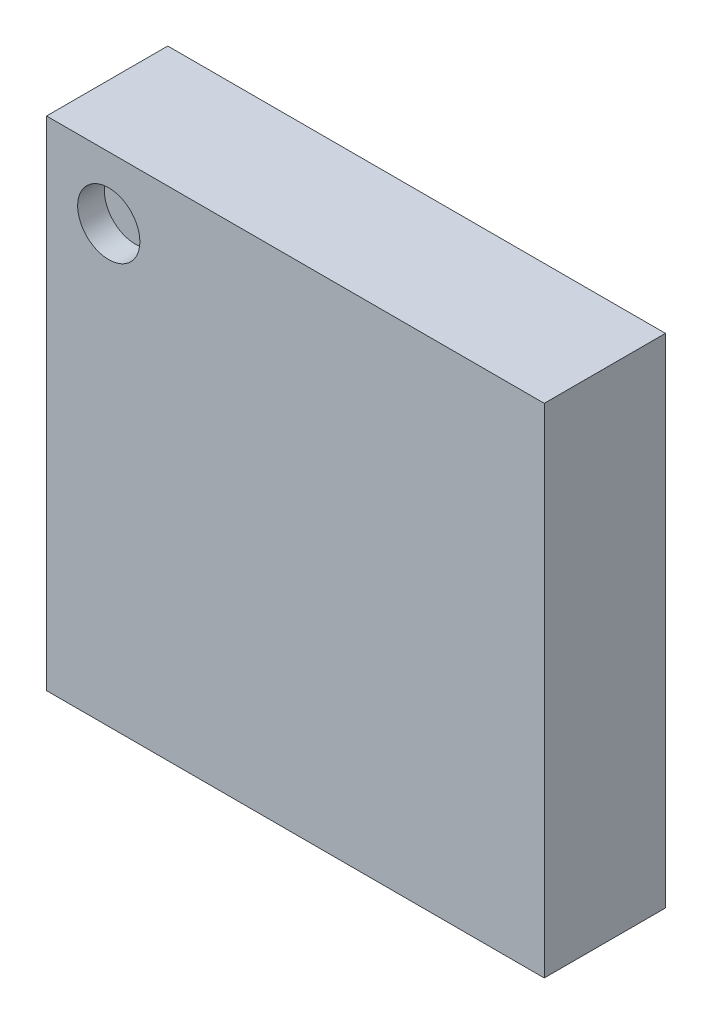
ISO-10303-21;
HEADER;
FILE_DESCRIPTION(('STEP AP214'),'2;1');
FILE_NAME('part.step','',(''),(''),'','','');
FILE_SCHEMA(('AUTOMOTIVE_DESIGN { 1 0 10303 214 1 1 1 1 }'));
ENDSEC;
DATA;
#1=APPLICATION_CONTEXT('core data for automotive mechanical design processes');
#2=APPLICATION_PROTOCOL_DEFINITION('international standard','automotive_design',2000,#1);
#3=PRODUCT_CONTEXT('',#1,'mechanical');
#4=PRODUCT('Part','Part','',(#3));
#5=PRODUCT_RELATED_PRODUCT_CATEGORY('part','',(#4));
#6=PRODUCT_DEFINITION_FORMATION('','',#4);
#7=PRODUCT_DEFINITION_CONTEXT('part definition',#1,'design');
#8=PRODUCT_DEFINITION('design','',#6,#7);
#9=PRODUCT_DEFINITION_SHAPE('','',#8);
#10=(LENGTH_UNIT() NAMED_UNIT(*) SI_UNIT(.MILLI.,.METRE.));
#11=(NAMED_UNIT(*) PLANE_ANGLE_UNIT() SI_UNIT($,.RADIAN.));
#12=(NAMED_UNIT(*) SI_UNIT($,.STERADIAN.) SOLID_ANGLE_UNIT());
#13=UNCERTAINTY_MEASURE_WITH_UNIT(LENGTH_MEASURE(1.E-05),#10,'distance_accuracy_value','');
#14=(GEOMETRIC_REPRESENTATION_CONTEXT(3) GLOBAL_UNCERTAINTY_ASSIGNED_CONTEXT((#13)) GLOBAL_UNIT_ASSIGNED_CONTEXT((#10,
#11,#12)) REPRESENTATION_CONTEXT('',''));
#15=CARTESIAN_POINT('',(0.,0.,0.));
#16=DIRECTION('',(0.,0.,1.));
#17=DIRECTION('',(1.,0.,0.));
#18=AXIS2_PLACEMENT_3D('',#15,#16,#17);
#19=CARTESIAN_POINT('',(-0.308,-0.308,0.18));
#20=DIRECTION('',(1.,0.,0.));
#21=DIRECTION('',(0.,0.,1.));
#22=AXIS2_PLACEMENT_3D('',#19,#20,#21);
#23=PLANE('',#22);
#24=DIRECTION('',(0.,1.,0.));
#25=VECTOR('',#24,1.);
#26=CARTESIAN_POINT('',(-0.308,-0.308,0.33));
#27=LINE('',#26,#25);
#28=CARTESIAN_POINT('',(-0.308,-0.308,0.33));
#29=VERTEX_POINT('',#28);
#30=CARTESIAN_POINT('',(-0.308,0.308,0.33));
#31=VERTEX_POINT('',#30);
#32=EDGE_CURVE('E11',#29,#31,#27,.T.);
#33=ORIENTED_EDGE('',*,*,#32,.T.);
#34=DIRECTION('',(0.,0.,1.));
#35=VECTOR('',#34,1.);
#36=CARTESIAN_POINT('',(-0.308,0.308,0.18));
#37=LINE('',#36,#35);
#38=CARTESIAN_POINT('',(-0.308,0.308,0.18));
#39=VERTEX_POINT('',#38);
#40=EDGE_CURVE('E24',#39,#31,#37,.T.);
#41=ORIENTED_EDGE('',*,*,#40,.F.);
#42=DIRECTION('',(0.,1.,0.));
#43=VECTOR('',#42,1.);
#44=CARTESIAN_POINT('',(-0.308,-0.308,0.18));
#45=LINE('',#44,#43);
#46=CARTESIAN_POINT('',(-0.308,-0.308,0.18));
#47=VERTEX_POINT('',#46);
#48=EDGE_CURVE('E95',#47,#39,#45,.T.);
#49=ORIENTED_EDGE('',*,*,#48,.F.);
#50=DIRECTION('',(0.,0.,1.));
#51=VECTOR('',#50,1.);
#52=CARTESIAN_POINT('',(-0.308,-0.308,0.18));
#53=LINE('',#52,#51);
#54=EDGE_CURVE('E36',#47,#29,#53,.T.);
#55=ORIENTED_EDGE('',*,*,#54,.T.);
#56=EDGE_LOOP('',(#33,#41,#49,#55));
#57=FACE_BOUND('',#56,.T.);
#58=ADVANCED_FACE('F17',(#57),#23,.F.);
#59=CARTESIAN_POINT('',(-0.308,-0.308,0.18));
#60=DIRECTION('',(0.,1.,0.));
#61=DIRECTION('',(0.,0.,1.));
#62=AXIS2_PLACEMENT_3D('',#59,#60,#61);
#63=PLANE('',#62);
#64=DIRECTION('',(0.,0.,1.));
#65=VECTOR('',#64,1.);
#66=CARTESIAN_POINT('',(0.308,-0.308,0.18));
#67=LINE('',#66,#65);
#68=CARTESIAN_POINT('',(0.308,-0.308,0.18));
#69=VERTEX_POINT('',#68);
#70=CARTESIAN_POINT('',(0.308,-0.308,0.33));
#71=VERTEX_POINT('',#70);
#72=EDGE_CURVE('E91',#69,#71,#67,.T.);
#73=ORIENTED_EDGE('',*,*,#72,.T.);
#74=DIRECTION('',(1.,0.,0.));
#75=VECTOR('',#74,1.);
#76=CARTESIAN_POINT('',(-0.308,-0.308,0.33));
#77=LINE('',#76,#75);
#78=EDGE_CURVE('E89',#29,#71,#77,.T.);
#79=ORIENTED_EDGE('',*,*,#78,.F.);
#80=ORIENTED_EDGE('',*,*,#54,.F.);
#81=DIRECTION('',(1.,0.,0.));
#82=VECTOR('',#81,1.);
#83=CARTESIAN_POINT('',(-0.308,-0.308,0.18));
#84=LINE('',#83,#82);
#85=EDGE_CURVE('E87',#47,#69,#84,.T.);
#86=ORIENTED_EDGE('',*,*,#85,.T.);
#87=EDGE_LOOP('',(#73,#79,#80,#86));
#88=FACE_BOUND('',#87,.T.);
#89=ADVANCED_FACE('F109',(#88),#63,.F.);
#90=CARTESIAN_POINT('',(-0.308,-0.308,0.33));
#91=DIRECTION('',(0.,0.,1.));
#92=DIRECTION('',(1.,0.,0.));
#93=AXIS2_PLACEMENT_3D('',#90,#91,#92);
#94=PLANE('',#93);
#95=ORIENTED_EDGE('',*,*,#32,.F.);
#96=ORIENTED_EDGE('',*,*,#78,.T.);
#97=DIRECTION('',(0.,1.,0.));
#98=VECTOR('',#97,1.);
#99=CARTESIAN_POINT('',(0.308,-0.308,0.33));
#100=LINE('',#99,#98);
#101=CARTESIAN_POINT('',(0.308,0.308,0.33));
#102=VERTEX_POINT('',#101);
#103=EDGE_CURVE('E85',#71,#102,#100,.T.);
#104=ORIENTED_EDGE('',*,*,#103,.T.);
#105=DIRECTION('',(1.,0.,0.));
#106=VECTOR('',#105,1.);
#107=CARTESIAN_POINT('',(-0.308,0.308,0.33));
#108=LINE('',#107,#106);
#109=EDGE_CURVE('E83',#31,#102,#108,.T.);
#110=ORIENTED_EDGE('',*,*,#109,.F.);
#111=EDGE_LOOP('',(#95,#96,#104,#110));
#112=FACE_BOUND('',#111,.T.);
#113=CARTESIAN_POINT('',(-0.231,0.231,0.33));
#114=DIRECTION('',(0.,0.,1.));
#115=DIRECTION('',(1.,0.,0.));
#116=AXIS2_PLACEMENT_3D('',#113,#114,#115);
#117=CIRCLE('',#116,0.0385);
#118=CARTESIAN_POINT('',(-0.1925,0.231,0.33));
#119=VERTEX_POINT('',#118);
#120=EDGE_CURVE('E68',#119,#119,#117,.T.);
#121=ORIENTED_EDGE('',*,*,#120,.F.);
#122=EDGE_LOOP('',(#121));
#123=FACE_BOUND('',#122,.T.);
#124=ADVANCED_FACE('F111',(#112,#123),#94,.T.);
#125=CARTESIAN_POINT('',(-0.308,0.308,0.18));
#126=DIRECTION('',(0.,1.,0.));
#127=DIRECTION('',(0.,0.,1.));
#128=AXIS2_PLACEMENT_3D('',#125,#126,#127);
#129=PLANE('',#128);
#130=DIRECTION('',(1.,0.,0.));
#131=VECTOR('',#130,1.);
#132=CARTESIAN_POINT('',(-0.308,0.308,0.18));
#133=LINE('',#132,#131);
#134=CARTESIAN_POINT('',(0.308,0.308,0.18));
#135=VERTEX_POINT('',#134);
#136=EDGE_CURVE('E80',#39,#135,#133,.T.);
#137=ORIENTED_EDGE('',*,*,#136,.F.);
#138=ORIENTED_EDGE('',*,*,#40,.T.);
#139=ORIENTED_EDGE('',*,*,#109,.T.);
#140=DIRECTION('',(0.,0.,1.));
#141=VECTOR('',#140,1.);
#142=CARTESIAN_POINT('',(0.308,0.308,0.18));
#143=LINE('',#142,#141);
#144=EDGE_CURVE('E75',#135,#102,#143,.T.);
#145=ORIENTED_EDGE('',*,*,#144,.F.);
#146=EDGE_LOOP('',(#137,#138,#139,#145));
#147=FACE_BOUND('',#146,.T.);
#148=ADVANCED_FACE('F102',(#147),#129,.T.);
#149=CARTESIAN_POINT('',(-0.308,-0.308,0.18));
#150=DIRECTION('',(0.,0.,1.));
#151=DIRECTION('',(1.,0.,0.));
#152=AXIS2_PLACEMENT_3D('',#149,#150,#151);
#153=PLANE('',#152);
#154=ORIENTED_EDGE('',*,*,#136,.T.);
#155=DIRECTION('',(0.,1.,0.));
#156=VECTOR('',#155,1.);
#157=CARTESIAN_POINT('',(0.308,-0.308,0.18));
#158=LINE('',#157,#156);
#159=EDGE_CURVE('E72',#69,#135,#158,.T.);
#160=ORIENTED_EDGE('',*,*,#159,.F.);
#161=ORIENTED_EDGE('',*,*,#85,.F.);
#162=ORIENTED_EDGE('',*,*,#48,.T.);
#163=EDGE_LOOP('',(#154,#160,#161,#162));
#164=FACE_BOUND('',#163,.T.);
#165=ADVANCED_FACE('F98',(#164),#153,.F.);
#166=CARTESIAN_POINT('',(0.308,-0.308,0.18));
#167=DIRECTION('',(1.,0.,0.));
#168=DIRECTION('',(0.,0.,1.));
#169=AXIS2_PLACEMENT_3D('',#166,#167,#168);
#170=PLANE('',#169);
#171=ORIENTED_EDGE('',*,*,#72,.F.);
#172=ORIENTED_EDGE('',*,*,#159,.T.);
#173=ORIENTED_EDGE('',*,*,#144,.T.);
#174=ORIENTED_EDGE('',*,*,#103,.F.);
#175=EDGE_LOOP('',(#171,#172,#173,#174));
#176=FACE_BOUND('',#175,.T.);
#177=ADVANCED_FACE('F106',(#176),#170,.T.);
#178=CARTESIAN_POINT('',(-0.231,0.231,0.297));
#179=DIRECTION('',(0.,0.,1.));
#180=DIRECTION('',(1.,0.,0.));
#181=AXIS2_PLACEMENT_3D('',#178,#179,#180);
#182=CYLINDRICAL_SURFACE('',#181,0.0385);
#183=CARTESIAN_POINT('',(-0.231,0.231,0.297));
#184=DIRECTION('',(0.,0.,1.));
#185=DIRECTION('',(1.,0.,0.));
#186=AXIS2_PLACEMENT_3D('',#183,#184,#185);
#187=CIRCLE('',#186,0.0385);
#188=CARTESIAN_POINT('',(-0.1925,0.231,0.297));
#189=VERTEX_POINT('',#188);
#190=EDGE_CURVE('E66',#189,#189,#187,.T.);
#191=ORIENTED_EDGE('',*,*,#190,.F.);
#192=DIRECTION('',(0.,0.,1.));
#193=VECTOR('',#192,1.);
#194=CARTESIAN_POINT('',(-0.1925,0.231,0.297));
#195=LINE('',#194,#193);
#196=EDGE_CURVE('E63',#189,#119,#195,.T.);
#197=ORIENTED_EDGE('',*,*,#196,.T.);
#198=ORIENTED_EDGE('',*,*,#120,.T.);
#199=ORIENTED_EDGE('',*,*,#196,.F.);
#200=EDGE_LOOP('',(#191,#197,#198,#199));
#201=FACE_BOUND('',#200,.T.);
#202=ADVANCED_FACE('F65',(#201),#182,.F.);
#203=CARTESIAN_POINT('',(-0.231,0.231,0.297));
#204=DIRECTION('',(0.,0.,1.));
#205=DIRECTION('',(1.,0.,0.));
#206=AXIS2_PLACEMENT_3D('',#203,#204,#205);
#207=PLANE('',#206);
#208=ORIENTED_EDGE('',*,*,#190,.T.);
#209=EDGE_LOOP('',(#208));
#210=FACE_BOUND('',#209,.T.);
#211=ADVANCED_FACE('F71',(#210),#207,.T.);
#212=CLOSED_SHELL('',(#58,#89,#124,#148,#165,#177,#202,#211));
#213=MANIFOLD_SOLID_BREP('B1',#212);
#214=ADVANCED_BREP_SHAPE_REPRESENTATION('',(#18,#213),#14);
#215=SHAPE_DEFINITION_REPRESENTATION(#9,#214);
ENDSEC;
END-ISO-10303-21;
